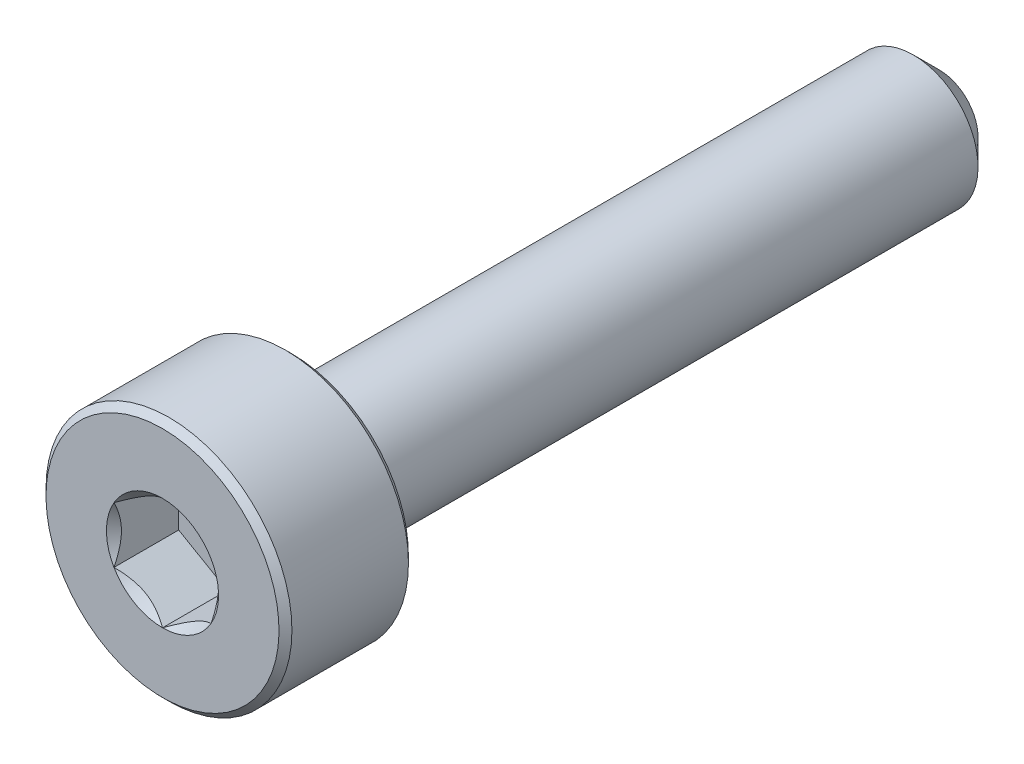
ISO-10303-21;
HEADER;
FILE_DESCRIPTION(('STEP AP214'),'2;1');
FILE_NAME('part.step','',(''),(''),'','','');
FILE_SCHEMA(('AUTOMOTIVE_DESIGN { 1 0 10303 214 1 1 1 1 }'));
ENDSEC;
DATA;
#1=APPLICATION_CONTEXT('core data for automotive mechanical design processes');
#2=APPLICATION_PROTOCOL_DEFINITION('international standard','automotive_design',2000,#1);
#3=PRODUCT_CONTEXT('',#1,'mechanical');
#4=PRODUCT('Part','Part','',(#3));
#5=PRODUCT_RELATED_PRODUCT_CATEGORY('part','',(#4));
#6=PRODUCT_DEFINITION_FORMATION('','',#4);
#7=PRODUCT_DEFINITION_CONTEXT('part definition',#1,'design');
#8=PRODUCT_DEFINITION('design','',#6,#7);
#9=PRODUCT_DEFINITION_SHAPE('','',#8);
#10=(LENGTH_UNIT() NAMED_UNIT(*) SI_UNIT(.MILLI.,.METRE.));
#11=(NAMED_UNIT(*) PLANE_ANGLE_UNIT() SI_UNIT($,.RADIAN.));
#12=(NAMED_UNIT(*) SI_UNIT($,.STERADIAN.) SOLID_ANGLE_UNIT());
#13=UNCERTAINTY_MEASURE_WITH_UNIT(LENGTH_MEASURE(1.E-05),#10,'distance_accuracy_value','');
#14=(GEOMETRIC_REPRESENTATION_CONTEXT(3) GLOBAL_UNCERTAINTY_ASSIGNED_CONTEXT((#13)) GLOBAL_UNIT_ASSIGNED_CONTEXT((#10,
#11,#12)) REPRESENTATION_CONTEXT('',''));
#15=CARTESIAN_POINT('',(0.,0.,0.));
#16=DIRECTION('',(0.,0.,1.));
#17=DIRECTION('',(1.,0.,0.));
#18=AXIS2_PLACEMENT_3D('',#15,#16,#17);
#19=CARTESIAN_POINT('',(0.,0.,6.));
#20=DIRECTION('',(0.,0.,1.));
#21=DIRECTION('',(0.,-1.,0.));
#22=AXIS2_PLACEMENT_3D('',#19,#20,#21);
#23=PLANE('',#22);
#24=CARTESIAN_POINT('',(0.,0.,6.));
#25=DIRECTION('',(0.,0.,1.));
#26=DIRECTION('',(1.,0.,0.));
#27=AXIS2_PLACEMENT_3D('',#24,#25,#26);
#28=CIRCLE('',#27,0.866025403784438);
#29=CARTESIAN_POINT('',(0.,-0.866025403784438,6.));
#30=VERTEX_POINT('',#29);
#31=CARTESIAN_POINT('',(0.75,-0.433012701892219,6.));
#32=VERTEX_POINT('',#31);
#33=EDGE_CURVE('E98',#30,#32,#28,.T.);
#34=ORIENTED_EDGE('',*,*,#33,.F.);
#35=CARTESIAN_POINT('',(-0.75,-0.433012701892219,6.));
#36=VERTEX_POINT('',#35);
#37=EDGE_CURVE('E268',#36,#30,#28,.T.);
#38=ORIENTED_EDGE('',*,*,#37,.F.);
#39=CARTESIAN_POINT('',(-0.75,0.433012701892219,6.));
#40=VERTEX_POINT('',#39);
#41=EDGE_CURVE('E133',#40,#36,#28,.T.);
#42=ORIENTED_EDGE('',*,*,#41,.F.);
#43=CARTESIAN_POINT('',(0.,0.866025403784438,6.));
#44=VERTEX_POINT('',#43);
#45=EDGE_CURVE('E129',#44,#40,#28,.T.);
#46=ORIENTED_EDGE('',*,*,#45,.F.);
#47=CARTESIAN_POINT('',(0.749999999999999,0.43301270189222,6.));
#48=VERTEX_POINT('',#47);
#49=EDGE_CURVE('E100',#48,#44,#28,.T.);
#50=ORIENTED_EDGE('',*,*,#49,.F.);
#51=EDGE_CURVE('E92',#32,#48,#28,.T.);
#52=ORIENTED_EDGE('',*,*,#51,.F.);
#53=EDGE_LOOP('',(#34,#38,#42,#46,#50,#52));
#54=FACE_BOUND('',#53,.T.);
#55=CARTESIAN_POINT('',(0.,0.,6.));
#56=DIRECTION('',(0.,0.,-1.));
#57=DIRECTION('',(0.,1.,0.));
#58=AXIS2_PLACEMENT_3D('',#55,#56,#57);
#59=CIRCLE('',#58,1.8);
#60=CARTESIAN_POINT('',(0.,1.8,6.));
#61=VERTEX_POINT('',#60);
#62=EDGE_CURVE('E48',#61,#61,#59,.T.);
#63=ORIENTED_EDGE('',*,*,#62,.F.);
#64=EDGE_LOOP('',(#63));
#65=FACE_BOUND('',#64,.T.);
#66=ADVANCED_FACE('F35',(#54,#65),#23,.T.);
#67=CARTESIAN_POINT('',(0.,0.,5.9));
#68=DIRECTION('',(0.,0.,-1.));
#69=DIRECTION('',(0.,1.,0.));
#70=AXIS2_PLACEMENT_3D('',#67,#68,#69);
#71=CONICAL_SURFACE('',#70,1.9,0.785398163397452);
#72=ORIENTED_EDGE('',*,*,#62,.T.);
#73=EDGE_LOOP('',(#72));
#74=FACE_BOUND('',#73,.T.);
#75=CARTESIAN_POINT('',(0.,0.,5.9));
#76=DIRECTION('',(0.,0.,-1.));
#77=DIRECTION('',(0.,1.,0.));
#78=AXIS2_PLACEMENT_3D('',#75,#76,#77);
#79=CIRCLE('',#78,1.9);
#80=CARTESIAN_POINT('',(0.,1.9,5.9));
#81=VERTEX_POINT('',#80);
#82=EDGE_CURVE('E219',#81,#81,#79,.T.);
#83=ORIENTED_EDGE('',*,*,#82,.F.);
#84=EDGE_LOOP('',(#83));
#85=FACE_BOUND('',#84,.T.);
#86=ADVANCED_FACE('F207',(#74,#85),#71,.T.);
#87=CARTESIAN_POINT('',(0.,0.,-6.));
#88=DIRECTION('',(0.,0.,-1.));
#89=DIRECTION('',(0.,1.,0.));
#90=AXIS2_PLACEMENT_3D('',#87,#88,#89);
#91=CYLINDRICAL_SURFACE('',#90,1.9);
#92=ORIENTED_EDGE('',*,*,#82,.T.);
#93=EDGE_LOOP('',(#92));
#94=FACE_BOUND('',#93,.T.);
#95=CARTESIAN_POINT('',(0.,0.,4.1));
#96=DIRECTION('',(0.,0.,-1.));
#97=DIRECTION('',(0.,1.,0.));
#98=AXIS2_PLACEMENT_3D('',#95,#96,#97);
#99=CIRCLE('',#98,1.9);
#100=CARTESIAN_POINT('',(0.,1.9,4.1));
#101=VERTEX_POINT('',#100);
#102=EDGE_CURVE('E220',#101,#101,#99,.T.);
#103=ORIENTED_EDGE('',*,*,#102,.F.);
#104=EDGE_LOOP('',(#103));
#105=FACE_BOUND('',#104,.T.);
#106=ADVANCED_FACE('F204',(#94,#105),#91,.T.);
#107=CARTESIAN_POINT('',(0.,0.,4.));
#108=DIRECTION('',(0.,0.,1.));
#109=DIRECTION('',(0.,-1.,0.));
#110=AXIS2_PLACEMENT_3D('',#107,#108,#109);
#111=CONICAL_SURFACE('',#110,1.8,0.785398163397443);
#112=ORIENTED_EDGE('',*,*,#102,.T.);
#113=EDGE_LOOP('',(#112));
#114=FACE_BOUND('',#113,.T.);
#115=CARTESIAN_POINT('',(0.,0.,4.));
#116=DIRECTION('',(0.,0.,-1.));
#117=DIRECTION('',(0.,1.,0.));
#118=AXIS2_PLACEMENT_3D('',#115,#116,#117);
#119=CIRCLE('',#118,1.8);
#120=CARTESIAN_POINT('',(0.,1.8,4.));
#121=VERTEX_POINT('',#120);
#122=EDGE_CURVE('E223',#121,#121,#119,.T.);
#123=ORIENTED_EDGE('',*,*,#122,.F.);
#124=EDGE_LOOP('',(#123));
#125=FACE_BOUND('',#124,.T.);
#126=ADVANCED_FACE('F200',(#114,#125),#111,.T.);
#127=CARTESIAN_POINT('',(0.,1.8,4.));
#128=DIRECTION('',(0.,0.,-1.));
#129=DIRECTION('',(0.,1.,0.));
#130=AXIS2_PLACEMENT_3D('',#127,#128,#129);
#131=PLANE('',#130);
#132=ORIENTED_EDGE('',*,*,#122,.T.);
#133=EDGE_LOOP('',(#132));
#134=FACE_BOUND('',#133,.T.);
#135=CARTESIAN_POINT('',(0.,0.,4.));
#136=DIRECTION('',(0.,0.,-1.));
#137=DIRECTION('',(0.,1.,0.));
#138=AXIS2_PLACEMENT_3D('',#135,#136,#137);
#139=CIRCLE('',#138,1.);
#140=CARTESIAN_POINT('',(0.,1.,4.));
#141=VERTEX_POINT('',#140);
#142=EDGE_CURVE('E228',#141,#141,#139,.T.);
#143=ORIENTED_EDGE('',*,*,#142,.F.);
#144=EDGE_LOOP('',(#143));
#145=FACE_BOUND('',#144,.T.);
#146=ADVANCED_FACE('F196',(#134,#145),#131,.T.);
#147=CARTESIAN_POINT('',(0.,0.,-6.));
#148=DIRECTION('',(0.,0.,-1.));
#149=DIRECTION('',(0.,1.,0.));
#150=AXIS2_PLACEMENT_3D('',#147,#148,#149);
#151=CYLINDRICAL_SURFACE('',#150,1.);
#152=ORIENTED_EDGE('',*,*,#142,.T.);
#153=EDGE_LOOP('',(#152));
#154=FACE_BOUND('',#153,.T.);
#155=CARTESIAN_POINT('',(0.,0.,-5.59999999999999));
#156=DIRECTION('',(0.,0.,-1.));
#157=DIRECTION('',(0.,1.,0.));
#158=AXIS2_PLACEMENT_3D('',#155,#156,#157);
#159=CIRCLE('',#158,1.);
#160=CARTESIAN_POINT('',(0.,1.,-5.59999999999999));
#161=VERTEX_POINT('',#160);
#162=EDGE_CURVE('E231',#161,#161,#159,.T.);
#163=ORIENTED_EDGE('',*,*,#162,.F.);
#164=EDGE_LOOP('',(#163));
#165=FACE_BOUND('',#164,.T.);
#166=ADVANCED_FACE('F192',(#154,#165),#151,.T.);
#167=CARTESIAN_POINT('',(0.,0.,-6.));
#168=DIRECTION('',(0.,0.,1.));
#169=DIRECTION('',(0.,-1.,0.));
#170=AXIS2_PLACEMENT_3D('',#167,#168,#169);
#171=CONICAL_SURFACE('',#170,0.6,0.78539816339744);
#172=ORIENTED_EDGE('',*,*,#162,.T.);
#173=EDGE_LOOP('',(#172));
#174=FACE_BOUND('',#173,.T.);
#175=CARTESIAN_POINT('',(0.,0.,-6.));
#176=DIRECTION('',(0.,0.,-1.));
#177=DIRECTION('',(0.,1.,0.));
#178=AXIS2_PLACEMENT_3D('',#175,#176,#177);
#179=CIRCLE('',#178,0.6);
#180=CARTESIAN_POINT('',(0.,0.6,-6.));
#181=VERTEX_POINT('',#180);
#182=EDGE_CURVE('E234',#181,#181,#179,.T.);
#183=ORIENTED_EDGE('',*,*,#182,.F.);
#184=EDGE_LOOP('',(#183));
#185=FACE_BOUND('',#184,.T.);
#186=ADVANCED_FACE('F188',(#174,#185),#171,.T.);
#187=CARTESIAN_POINT('',(0.,0.6,-6.));
#188=DIRECTION('',(0.,0.,-1.));
#189=DIRECTION('',(0.,1.,0.));
#190=AXIS2_PLACEMENT_3D('',#187,#188,#189);
#191=PLANE('',#190);
#192=ORIENTED_EDGE('',*,*,#182,.T.);
#193=EDGE_LOOP('',(#192));
#194=FACE_BOUND('',#193,.T.);
#195=ADVANCED_FACE('F185',(#194),#191,.T.);
#196=CARTESIAN_POINT('',(0.,0.,6.));
#197=DIRECTION('',(0.,0.,1.));
#198=DIRECTION('',(1.,0.,0.));
#199=AXIS2_PLACEMENT_3D('',#196,#197,#198);
#200=CONICAL_SURFACE('',#199,0.866025403784438,0.78539816339745);
#201=ORIENTED_EDGE('',*,*,#33,.T.);
#202=CARTESIAN_POINT('',(-0.000200000000000018,-0.866140873838276,6.00011549314477));
#203=CARTESIAN_POINT('',(0.0255899625576815,-0.851251032013208,5.98523411046392));
#204=CARTESIAN_POINT('',(0.0518112021286593,-0.836112192288419,5.97122626560696));
#205=CARTESIAN_POINT('',(0.105279708235707,-0.805242135894348,5.94557752468226));
#206=CARTESIAN_POINT('',(0.132532067460573,-0.789507978959819,5.93395091170567));
#207=CARTESIAN_POINT('',(0.187485350381354,-0.757780686272652,5.91403404577224));
#208=CARTESIAN_POINT('',(0.21517225669551,-0.741795643459146,5.90569369408137));
#209=CARTESIAN_POINT('',(0.271155595130854,-0.709473647943366,5.89284274196143));
#210=CARTESIAN_POINT('',(0.299450314843646,-0.693137683900541,5.88832254058884));
#211=CARTESIAN_POINT('',(0.348210289268844,-0.664986099540473,5.88424583309744));
#212=CARTESIAN_POINT('',(0.368612065655574,-0.653207128451649,5.88364279661408));
#213=CARTESIAN_POINT('',(0.409376134696361,-0.629671982217685,5.88465450601553));
#214=CARTESIAN_POINT('',(0.429738417651456,-0.617915812672246,5.88626974099003));
#215=CARTESIAN_POINT('',(0.490534543086825,-0.58281515328645,5.89433614697304));
#216=CARTESIAN_POINT('',(0.5306658549961,-0.559645329552697,5.90400893582772));
#217=CARTESIAN_POINT('',(0.601110400354027,-0.518974152327357,5.92735631797231));
#218=CARTESIAN_POINT('',(0.631753572009087,-0.501282308923484,5.93980855807225));
#219=CARTESIAN_POINT('',(0.69183934580479,-0.466591771248068,5.96785961023086));
#220=CARTESIAN_POINT('',(0.721285488381591,-0.449591032904756,5.98344818590375));
#221=CARTESIAN_POINT('',(0.7502,-0.432897231838381,6.00011549314477));
#222=B_SPLINE_CURVE_WITH_KNOTS('',3,(#202,#203,#204,#205,#206,#207,#208,#209,#210,#211,#212,
#213,#214,#215,#216,#217,#218,#219,#220,#221),.UNSPECIFIED.,.F.,.F.,(4,2,2,2,2,2,2,2,2,4),(0.,
0.0999419466095601,0.200466857654447,0.299393763705719,0.398071297300232,0.468665775681749,
0.539275821398841,0.680536257244568,0.792918418368075,0.904939568716032),.UNSPECIFIED.);
#223=EDGE_CURVE('E12',#30,#32,#222,.T.);
#224=ORIENTED_EDGE('',*,*,#223,.F.);
#225=EDGE_LOOP('',(#201,#224));
#226=FACE_BOUND('',#225,.T.);
#227=ADVANCED_FACE('F151',(#226),#200,.F.);
#228=ORIENTED_EDGE('',*,*,#37,.T.);
#229=CARTESIAN_POINT('',(-0.7502,-0.432897231838381,6.00011549314477));
#230=CARTESIAN_POINT('',(-0.724410037442318,-0.447787073663449,5.98523411046392));
#231=CARTESIAN_POINT('',(-0.698188797871341,-0.462925913388239,5.97122626560696));
#232=CARTESIAN_POINT('',(-0.644720291764293,-0.493795969782309,5.94557752468226));
#233=CARTESIAN_POINT('',(-0.617467932539427,-0.509530126716838,5.93395091170567));
#234=CARTESIAN_POINT('',(-0.562514649618647,-0.541257419404005,5.91403404577224));
#235=CARTESIAN_POINT('',(-0.53482774330449,-0.557242462217511,5.90569369408137));
#236=CARTESIAN_POINT('',(-0.478844404869146,-0.589564457733291,5.89284274196143));
#237=CARTESIAN_POINT('',(-0.450549685156354,-0.605900421776116,5.88832254058884));
#238=CARTESIAN_POINT('',(-0.401789710731156,-0.634052006136184,5.88424583309744));
#239=CARTESIAN_POINT('',(-0.381387934344426,-0.645830977225008,5.88364279661408));
#240=CARTESIAN_POINT('',(-0.340623865303639,-0.669366123458972,5.88465450601553));
#241=CARTESIAN_POINT('',(-0.320261582348544,-0.681122293004411,5.88626974099003));
#242=CARTESIAN_POINT('',(-0.259465456913175,-0.716222952390207,5.89433614697304));
#243=CARTESIAN_POINT('',(-0.2193341450039,-0.73939277612396,5.90400893582772));
#244=CARTESIAN_POINT('',(-0.148889599645973,-0.7800639533493,5.92735631797231));
#245=CARTESIAN_POINT('',(-0.118246427990913,-0.797755796753173,5.93980855807225));
#246=CARTESIAN_POINT('',(-0.0581606541952095,-0.832446334428589,5.96785961023086));
#247=CARTESIAN_POINT('',(-0.0287145116184087,-0.849447072771901,5.98344818590375));
#248=CARTESIAN_POINT('',(0.000200000000000237,-0.866140873838276,6.00011549314477));
#249=B_SPLINE_CURVE_WITH_KNOTS('',3,(#229,#230,#231,#232,#233,#234,#235,#236,#237,#238,#239,
#240,#241,#242,#243,#244,#245,#246,#247,#248),.UNSPECIFIED.,.F.,.F.,(4,2,2,2,2,2,2,2,2,4),(0.,
0.0999419466095595,0.200466857654446,0.299393763705718,0.398071297300231,0.468665775681749,
0.53927582139884,0.680536257244567,0.792918418368074,0.904939568716032),.UNSPECIFIED.);
#250=EDGE_CURVE('E130',#36,#30,#249,.T.);
#251=ORIENTED_EDGE('',*,*,#250,.F.);
#252=EDGE_LOOP('',(#228,#251));
#253=FACE_BOUND('',#252,.T.);
#254=ADVANCED_FACE('F266',(#253),#200,.F.);
#255=ORIENTED_EDGE('',*,*,#41,.T.);
#256=CARTESIAN_POINT('',(-0.75,-0.863604064848462,6.2777892581354));
#257=CARTESIAN_POINT('',(-0.75,-0.842575879734332,6.26191493200841));
#258=CARTESIAN_POINT('',(-0.75,-0.82143049629156,6.246196265183));
#259=CARTESIAN_POINT('',(-0.75,-0.778857857419019,6.21513452062663));
#260=CARTESIAN_POINT('',(-0.75,-0.757430533042236,6.19979153749355));
#261=CARTESIAN_POINT('',(-0.75,-0.692340710712935,6.15420358029367));
#262=CARTESIAN_POINT('',(-0.75,-0.648190081053413,6.12464409174343));
#263=CARTESIAN_POINT('',(-0.75,-0.55560718150175,6.0666155826928));
#264=CARTESIAN_POINT('',(-0.75,-0.507074363017996,6.03830510936579));
#265=CARTESIAN_POINT('',(-0.75,-0.407587529772337,5.98651811176889));
#266=CARTESIAN_POINT('',(-0.75,-0.35664241954847,5.96302529153185));
#267=CARTESIAN_POINT('',(-0.75,-0.28016546882077,5.93428689950068));
#268=CARTESIAN_POINT('',(-0.75,-0.255770023930571,5.92603927481306));
#269=CARTESIAN_POINT('',(-0.75,-0.206403277885131,5.91149717542019));
#270=CARTESIAN_POINT('',(-0.75,-0.181431937185907,5.90520283526912));
#271=CARTESIAN_POINT('',(-0.75,-0.106699879404924,5.8899931738806));
#272=CARTESIAN_POINT('',(-0.75,-0.0561907171762171,5.88437718471289));
#273=CARTESIAN_POINT('',(-0.75,0.0430767231749066,5.88362825645435));
#274=CARTESIAN_POINT('',(-0.75,0.0918322434166288,5.88812345140561));
#275=CARTESIAN_POINT('',(-0.75,0.164112195698295,5.90133730744598));
#276=CARTESIAN_POINT('',(-0.75,0.188278676879437,5.90690144638208));
#277=CARTESIAN_POINT('',(-0.75,0.236094480120331,5.91992316614873));
#278=CARTESIAN_POINT('',(-0.75,0.259743845273041,5.92738058854766));
#279=CARTESIAN_POINT('',(-0.75,0.33419827846382,5.95366646946609));
#280=CARTESIAN_POINT('',(-0.75,0.383940060445496,5.97549033804844));
#281=CARTESIAN_POINT('',(-0.75,0.481089225076667,6.02401180410059));
#282=CARTESIAN_POINT('',(-0.75,0.528487417973018,6.05072691131035));
#283=CARTESIAN_POINT('',(-0.75,0.619071540465252,6.10584285115078));
#284=CARTESIAN_POINT('',(-0.75,0.66234974530024,6.13409394545219));
#285=CARTESIAN_POINT('',(-0.75,0.726111623216225,6.17776714709751));
#286=CARTESIAN_POINT('',(-0.75,0.747090419255281,6.1924788605167));
#287=CARTESIAN_POINT('',(-0.75,0.788761341501861,6.2222913841024));
#288=CARTESIAN_POINT('',(-0.75,0.80945354453562,6.23739208676303));
#289=CARTESIAN_POINT('',(-0.75,0.830026390097469,6.25265408930473));
#290=B_SPLINE_CURVE_WITH_KNOTS('',3,(#256,#257,#258,#259,#260,#261,#262,#263,#264,#265,#266,
#267,#268,#269,#270,#271,#272,#273,#274,#275,#276,#277,#278,#279,#280,#281,#282,#283,#284,#285,
#286,#287,#288,#289),.UNSPECIFIED.,.F.,.F.,(4,2,2,2,2,2,2,2,2,2,2,2,2,2,2,2,4),(0.,
0.0790398443124681,0.158099390497593,0.317425208674102,0.485845155681377,0.653685658303956,
0.730869805636065,0.808059268704008,0.959469653380779,1.10540290447489,1.17973203111653,
1.25405493988072,1.41653726506054,1.57961304287543,1.73458511695816,1.81145152932467,
1.8882969211581),.UNSPECIFIED.);
#291=EDGE_CURVE('E131',#40,#36,#290,.F.);
#292=ORIENTED_EDGE('',*,*,#291,.F.);
#293=EDGE_LOOP('',(#255,#292));
#294=FACE_BOUND('',#293,.T.);
#295=ADVANCED_FACE('F271',(#294),#200,.F.);
#296=ORIENTED_EDGE('',*,*,#45,.T.);
#297=CARTESIAN_POINT('',(0.000200000000000151,0.866140873838276,6.00011549314477));
#298=CARTESIAN_POINT('',(-0.0255899625576814,0.851251032013209,5.98523411046392));
#299=CARTESIAN_POINT('',(-0.0518112021286591,0.836112192288419,5.97122626560696));
#300=CARTESIAN_POINT('',(-0.105279708235706,0.805242135894348,5.94557752468226));
#301=CARTESIAN_POINT('',(-0.132532067460573,0.789507978959819,5.93395091170567));
#302=CARTESIAN_POINT('',(-0.187485350381353,0.757780686272653,5.91403404577224));
#303=CARTESIAN_POINT('',(-0.21517225669551,0.741795643459147,5.90569369408137));
#304=CARTESIAN_POINT('',(-0.271155595130853,0.709473647943367,5.89284274196143));
#305=CARTESIAN_POINT('',(-0.299450314843645,0.693137683900541,5.88832254058884));
#306=CARTESIAN_POINT('',(-0.348210289268844,0.664986099540474,5.88424583309744));
#307=CARTESIAN_POINT('',(-0.368612065655573,0.653207128451649,5.88364279661408));
#308=CARTESIAN_POINT('',(-0.409376134696361,0.629671982217686,5.88465450601553));
#309=CARTESIAN_POINT('',(-0.429738417651456,0.617915812672247,5.88626974099003));
#310=CARTESIAN_POINT('',(-0.490534543086824,0.58281515328645,5.89433614697304));
#311=CARTESIAN_POINT('',(-0.5306658549961,0.559645329552697,5.90400893582772));
#312=CARTESIAN_POINT('',(-0.601110400354026,0.518974152327358,5.92735631797231));
#313=CARTESIAN_POINT('',(-0.631753572009087,0.501282308923484,5.93980855807225));
#314=CARTESIAN_POINT('',(-0.69183934580479,0.466591771248068,5.96785961023086));
#315=CARTESIAN_POINT('',(-0.721285488381591,0.449591032904756,5.98344818590375));
#316=CARTESIAN_POINT('',(-0.7502,0.432897231838381,6.00011549314477));
#317=B_SPLINE_CURVE_WITH_KNOTS('',3,(#297,#298,#299,#300,#301,#302,#303,#304,#305,#306,#307,
#308,#309,#310,#311,#312,#313,#314,#315,#316),.UNSPECIFIED.,.F.,.F.,(4,2,2,2,2,2,2,2,2,4),(0.,
0.0999419466095596,0.200466857654446,0.299393763705718,0.398071297300231,0.468665775681749,
0.53927582139884,0.680536257244567,0.792918418368074,0.904939568716032),.UNSPECIFIED.);
#318=EDGE_CURVE('E110',#44,#40,#317,.T.);
#319=ORIENTED_EDGE('',*,*,#318,.F.);
#320=EDGE_LOOP('',(#296,#319));
#321=FACE_BOUND('',#320,.T.);
#322=ADVANCED_FACE('F305',(#321),#200,.F.);
#323=ORIENTED_EDGE('',*,*,#49,.T.);
#324=CARTESIAN_POINT('',(0.7502,0.432897231838381,6.00011549314477));
#325=CARTESIAN_POINT('',(0.724410037442319,0.447787073663449,5.98523411046392));
#326=CARTESIAN_POINT('',(0.698188797871341,0.462925913388239,5.97122626560696));
#327=CARTESIAN_POINT('',(0.644720291764294,0.49379596978231,5.94557752468226));
#328=CARTESIAN_POINT('',(0.617467932539427,0.509530126716839,5.93395091170567));
#329=CARTESIAN_POINT('',(0.562514649618647,0.541257419404005,5.91403404577224));
#330=CARTESIAN_POINT('',(0.534827743304491,0.557242462217511,5.90569369408137));
#331=CARTESIAN_POINT('',(0.478844404869147,0.58956445773329,5.89284274196143));
#332=CARTESIAN_POINT('',(0.450549685156355,0.605900421776116,5.88832254058884));
#333=CARTESIAN_POINT('',(0.401789710731157,0.634052006136183,5.88424583309744));
#334=CARTESIAN_POINT('',(0.381387934344428,0.645830977225008,5.88364279661408));
#335=CARTESIAN_POINT('',(0.34062386530364,0.669366123458971,5.88465450601553));
#336=CARTESIAN_POINT('',(0.320261582348545,0.681122293004411,5.88626974099003));
#337=CARTESIAN_POINT('',(0.259465456913177,0.716222952390207,5.89433614697304));
#338=CARTESIAN_POINT('',(0.219334145003901,0.73939277612396,5.90400893582772));
#339=CARTESIAN_POINT('',(0.148889599645975,0.780063953349299,5.92735631797231));
#340=CARTESIAN_POINT('',(0.118246427990914,0.797755796753173,5.93980855807225));
#341=CARTESIAN_POINT('',(0.0581606541952104,0.832446334428589,5.96785961023086));
#342=CARTESIAN_POINT('',(0.0287145116184094,0.849447072771901,5.98344818590375));
#343=CARTESIAN_POINT('',(-0.000200000000000016,0.866140873838276,6.00011549314477));
#344=B_SPLINE_CURVE_WITH_KNOTS('',3,(#324,#325,#326,#327,#328,#329,#330,#331,#332,#333,#334,
#335,#336,#337,#338,#339,#340,#341,#342,#343),.UNSPECIFIED.,.F.,.F.,(4,2,2,2,2,2,2,2,2,4),(0.,
0.0999419466095594,0.200466857654446,0.299393763705717,0.39807129730023,0.468665775681747,
0.539275821398839,0.680536257244566,0.792918418368073,0.904939568716032),.UNSPECIFIED.);
#345=EDGE_CURVE('E103',#48,#44,#344,.T.);
#346=ORIENTED_EDGE('',*,*,#345,.F.);
#347=EDGE_LOOP('',(#323,#346));
#348=FACE_BOUND('',#347,.T.);
#349=ADVANCED_FACE('F104',(#348),#200,.F.);
#350=ORIENTED_EDGE('',*,*,#51,.T.);
#351=CARTESIAN_POINT('',(0.75,-0.863604064848461,6.2777892581354));
#352=CARTESIAN_POINT('',(0.75,-0.842575879734331,6.26191493200841));
#353=CARTESIAN_POINT('',(0.75,-0.821430496291559,6.246196265183));
#354=CARTESIAN_POINT('',(0.75,-0.778857857419018,6.21513452062663));
#355=CARTESIAN_POINT('',(0.75,-0.757430533042235,6.19979153749355));
#356=CARTESIAN_POINT('',(0.75,-0.692340710712934,6.15420358029367));
#357=CARTESIAN_POINT('',(0.75,-0.648190081053412,6.12464409174343));
#358=CARTESIAN_POINT('',(0.75,-0.555607181501749,6.0666155826928));
#359=CARTESIAN_POINT('',(0.75,-0.507074363017995,6.03830510936579));
#360=CARTESIAN_POINT('',(0.75,-0.407587529772336,5.98651811176889));
#361=CARTESIAN_POINT('',(0.75,-0.356642419548469,5.96302529153185));
#362=CARTESIAN_POINT('',(0.75,-0.28016546882077,5.93428689950068));
#363=CARTESIAN_POINT('',(0.75,-0.255770023930571,5.92603927481306));
#364=CARTESIAN_POINT('',(0.75,-0.20640327788513,5.91149717542019));
#365=CARTESIAN_POINT('',(0.75,-0.181431937185906,5.90520283526912));
#366=CARTESIAN_POINT('',(0.75,-0.106699879404923,5.8899931738806));
#367=CARTESIAN_POINT('',(0.75,-0.0561907171762164,5.88437718471289));
#368=CARTESIAN_POINT('',(0.75,0.043076723174907,5.88362825645435));
#369=CARTESIAN_POINT('',(0.75,0.0918322434166292,5.88812345140561));
#370=CARTESIAN_POINT('',(0.75,0.164112195698295,5.90133730744598));
#371=CARTESIAN_POINT('',(0.75,0.188278676879437,5.90690144638208));
#372=CARTESIAN_POINT('',(0.75,0.236094480120331,5.91992316614873));
#373=CARTESIAN_POINT('',(0.75,0.259743845273042,5.92738058854766));
#374=CARTESIAN_POINT('',(0.75,0.33419827846382,5.95366646946609));
#375=CARTESIAN_POINT('',(0.75,0.383940060445496,5.97549033804844));
#376=CARTESIAN_POINT('',(0.75,0.481089225076667,6.02401180410059));
#377=CARTESIAN_POINT('',(0.75,0.528487417973018,6.05072691131035));
#378=CARTESIAN_POINT('',(0.75,0.619071540465253,6.10584285115078));
#379=CARTESIAN_POINT('',(0.75,0.662349745300241,6.13409394545219));
#380=CARTESIAN_POINT('',(0.75,0.726111623216226,6.17776714709751));
#381=CARTESIAN_POINT('',(0.75,0.747090419255282,6.1924788605167));
#382=CARTESIAN_POINT('',(0.75,0.788761341501862,6.2222913841024));
#383=CARTESIAN_POINT('',(0.75,0.809453544535621,6.23739208676303));
#384=CARTESIAN_POINT('',(0.75,0.83002639009747,6.25265408930473));
#385=B_SPLINE_CURVE_WITH_KNOTS('',3,(#351,#352,#353,#354,#355,#356,#357,#358,#359,#360,#361,
#362,#363,#364,#365,#366,#367,#368,#369,#370,#371,#372,#373,#374,#375,#376,#377,#378,#379,#380,
#381,#382,#383,#384),.UNSPECIFIED.,.F.,.F.,(4,2,2,2,2,2,2,2,2,2,2,2,2,2,2,2,4),(0.,
0.0790398443124674,0.158099390497593,0.317425208674101,0.485845155681376,0.653685658303956,
0.730869805636064,0.808059268704007,0.959469653380778,1.10540290447489,1.17973203111653,
1.25405493988072,1.41653726506053,1.57961304287543,1.73458511695816,1.81145152932466,
1.8882969211581),.UNSPECIFIED.);
#386=EDGE_CURVE('E54',#32,#48,#385,.T.);
#387=ORIENTED_EDGE('',*,*,#386,.F.);
#388=EDGE_LOOP('',(#350,#387));
#389=FACE_BOUND('',#388,.T.);
#390=ADVANCED_FACE('F94',(#389),#200,.F.);
#391=CARTESIAN_POINT('',(0.,1.8,5.));
#392=DIRECTION('',(0.,0.,-1.));
#393=DIRECTION('',(0.,1.,0.));
#394=AXIS2_PLACEMENT_3D('',#391,#392,#393);
#395=PLANE('',#394);
#396=DIRECTION('',(0.866025403784439,0.5,0.));
#397=VECTOR('',#396,1.);
#398=CARTESIAN_POINT('',(0.,-0.866025403784438,5.));
#399=LINE('',#398,#397);
#400=CARTESIAN_POINT('',(0.,-0.866025403784438,5.));
#401=VERTEX_POINT('',#400);
#402=CARTESIAN_POINT('',(0.75,-0.433012701892219,5.));
#403=VERTEX_POINT('',#402);
#404=EDGE_CURVE('E237',#401,#403,#399,.T.);
#405=ORIENTED_EDGE('',*,*,#404,.T.);
#406=DIRECTION('',(0.,1.,0.));
#407=VECTOR('',#406,1.);
#408=CARTESIAN_POINT('',(0.75,-0.433012701892219,5.));
#409=LINE('',#408,#407);
#410=CARTESIAN_POINT('',(0.75,0.433012701892219,5.));
#411=VERTEX_POINT('',#410);
#412=EDGE_CURVE('E120',#403,#411,#409,.T.);
#413=ORIENTED_EDGE('',*,*,#412,.T.);
#414=DIRECTION('',(-0.866025403784439,0.5,0.));
#415=VECTOR('',#414,1.);
#416=CARTESIAN_POINT('',(0.75,0.433012701892219,5.));
#417=LINE('',#416,#415);
#418=CARTESIAN_POINT('',(0.,0.866025403784438,5.));
#419=VERTEX_POINT('',#418);
#420=EDGE_CURVE('E124',#411,#419,#417,.T.);
#421=ORIENTED_EDGE('',*,*,#420,.T.);
#422=DIRECTION('',(-0.866025403784439,-0.5,0.));
#423=VECTOR('',#422,1.);
#424=CARTESIAN_POINT('',(0.,0.866025403784438,5.));
#425=LINE('',#424,#423);
#426=CARTESIAN_POINT('',(-0.75,0.433012701892219,5.));
#427=VERTEX_POINT('',#426);
#428=EDGE_CURVE('E241',#419,#427,#425,.T.);
#429=ORIENTED_EDGE('',*,*,#428,.T.);
#430=DIRECTION('',(0.,-1.,0.));
#431=VECTOR('',#430,1.);
#432=CARTESIAN_POINT('',(-0.75,0.433012701892219,5.));
#433=LINE('',#432,#431);
#434=CARTESIAN_POINT('',(-0.75,-0.433012701892219,5.));
#435=VERTEX_POINT('',#434);
#436=EDGE_CURVE('E245',#427,#435,#433,.T.);
#437=ORIENTED_EDGE('',*,*,#436,.T.);
#438=DIRECTION('',(0.866025403784439,-0.5,0.));
#439=VECTOR('',#438,1.);
#440=CARTESIAN_POINT('',(-0.75,-0.433012701892219,5.));
#441=LINE('',#440,#439);
#442=EDGE_CURVE('E247',#435,#401,#441,.T.);
#443=ORIENTED_EDGE('',*,*,#442,.T.);
#444=EDGE_LOOP('',(#405,#413,#421,#429,#437,#443));
#445=FACE_BOUND('',#444,.T.);
#446=ADVANCED_FACE('F150',(#445),#395,.F.);
#447=CARTESIAN_POINT('',(0.,-0.866025403784438,1.70871215252208));
#448=DIRECTION('',(0.5,-0.866025403784439,0.));
#449=DIRECTION('',(0.866025403784439,0.5,0.));
#450=AXIS2_PLACEMENT_3D('',#447,#448,#449);
#451=PLANE('',#450);
#452=DIRECTION('',(0.,0.,1.));
#453=VECTOR('',#452,1.);
#454=CARTESIAN_POINT('',(0.,-0.866025403784438,1.70871215252208));
#455=LINE('',#454,#453);
#456=EDGE_CURVE('E248',#401,#30,#455,.T.);
#457=ORIENTED_EDGE('',*,*,#456,.T.);
#458=ORIENTED_EDGE('',*,*,#223,.T.);
#459=DIRECTION('',(0.,0.,1.));
#460=VECTOR('',#459,1.);
#461=CARTESIAN_POINT('',(0.75,-0.433012701892219,1.70871215252208));
#462=LINE('',#461,#460);
#463=EDGE_CURVE('E119',#403,#32,#462,.T.);
#464=ORIENTED_EDGE('',*,*,#463,.F.);
#465=ORIENTED_EDGE('',*,*,#404,.F.);
#466=EDGE_LOOP('',(#457,#458,#464,#465));
#467=FACE_BOUND('',#466,.T.);
#468=ADVANCED_FACE('F152',(#467),#451,.F.);
#469=CARTESIAN_POINT('',(-0.75,-0.433012701892219,1.70871215252208));
#470=DIRECTION('',(-0.5,-0.866025403784439,0.));
#471=DIRECTION('',(0.866025403784439,-0.5,0.));
#472=AXIS2_PLACEMENT_3D('',#469,#470,#471);
#473=PLANE('',#472);
#474=DIRECTION('',(0.,0.,1.));
#475=VECTOR('',#474,1.);
#476=CARTESIAN_POINT('',(-0.75,-0.433012701892219,1.70871215252208));
#477=LINE('',#476,#475);
#478=EDGE_CURVE('E62',#435,#36,#477,.T.);
#479=ORIENTED_EDGE('',*,*,#478,.T.);
#480=ORIENTED_EDGE('',*,*,#250,.T.);
#481=ORIENTED_EDGE('',*,*,#456,.F.);
#482=ORIENTED_EDGE('',*,*,#442,.F.);
#483=EDGE_LOOP('',(#479,#480,#481,#482));
#484=FACE_BOUND('',#483,.T.);
#485=ADVANCED_FACE('F146',(#484),#473,.F.);
#486=CARTESIAN_POINT('',(-0.75,0.433012701892219,1.70871215252208));
#487=DIRECTION('',(-1.,0.,0.));
#488=DIRECTION('',(0.,-1.,0.));
#489=AXIS2_PLACEMENT_3D('',#486,#487,#488);
#490=PLANE('',#489);
#491=DIRECTION('',(0.,0.,1.));
#492=VECTOR('',#491,1.);
#493=CARTESIAN_POINT('',(-0.75,0.433012701892219,1.70871215252208));
#494=LINE('',#493,#492);
#495=EDGE_CURVE('E242',#427,#40,#494,.T.);
#496=ORIENTED_EDGE('',*,*,#495,.T.);
#497=ORIENTED_EDGE('',*,*,#291,.T.);
#498=ORIENTED_EDGE('',*,*,#478,.F.);
#499=ORIENTED_EDGE('',*,*,#436,.F.);
#500=EDGE_LOOP('',(#496,#497,#498,#499));
#501=FACE_BOUND('',#500,.T.);
#502=ADVANCED_FACE('F277',(#501),#490,.F.);
#503=CARTESIAN_POINT('',(0.,0.866025403784438,1.70871215252208));
#504=DIRECTION('',(-0.5,0.866025403784439,0.));
#505=DIRECTION('',(-0.866025403784439,-0.5,0.));
#506=AXIS2_PLACEMENT_3D('',#503,#504,#505);
#507=PLANE('',#506);
#508=DIRECTION('',(0.,0.,1.));
#509=VECTOR('',#508,1.);
#510=CARTESIAN_POINT('',(0.,0.866025403784438,1.70871215252208));
#511=LINE('',#510,#509);
#512=EDGE_CURVE('E239',#419,#44,#511,.T.);
#513=ORIENTED_EDGE('',*,*,#512,.T.);
#514=ORIENTED_EDGE('',*,*,#318,.T.);
#515=ORIENTED_EDGE('',*,*,#495,.F.);
#516=ORIENTED_EDGE('',*,*,#428,.F.);
#517=EDGE_LOOP('',(#513,#514,#515,#516));
#518=FACE_BOUND('',#517,.T.);
#519=ADVANCED_FACE('F177',(#518),#507,.F.);
#520=CARTESIAN_POINT('',(0.75,0.433012701892219,1.70871215252208));
#521=DIRECTION('',(0.5,0.866025403784439,0.));
#522=DIRECTION('',(-0.866025403784439,0.5,0.));
#523=AXIS2_PLACEMENT_3D('',#520,#521,#522);
#524=PLANE('',#523);
#525=DIRECTION('',(0.,0.,1.));
#526=VECTOR('',#525,1.);
#527=CARTESIAN_POINT('',(0.75,0.433012701892219,1.70871215252208));
#528=LINE('',#527,#526);
#529=EDGE_CURVE('E116',#411,#48,#528,.T.);
#530=ORIENTED_EDGE('',*,*,#529,.T.);
#531=ORIENTED_EDGE('',*,*,#345,.T.);
#532=ORIENTED_EDGE('',*,*,#512,.F.);
#533=ORIENTED_EDGE('',*,*,#420,.F.);
#534=EDGE_LOOP('',(#530,#531,#532,#533));
#535=FACE_BOUND('',#534,.T.);
#536=ADVANCED_FACE('F122',(#535),#524,.F.);
#537=CARTESIAN_POINT('',(0.75,-0.433012701892219,1.70871215252208));
#538=DIRECTION('',(1.,0.,0.));
#539=DIRECTION('',(0.,0.,-1.));
#540=AXIS2_PLACEMENT_3D('',#537,#538,#539);
#541=PLANE('',#540);
#542=ORIENTED_EDGE('',*,*,#463,.T.);
#543=ORIENTED_EDGE('',*,*,#386,.T.);
#544=ORIENTED_EDGE('',*,*,#529,.F.);
#545=ORIENTED_EDGE('',*,*,#412,.F.);
#546=EDGE_LOOP('',(#542,#543,#544,#545));
#547=FACE_BOUND('',#546,.T.);
#548=ADVANCED_FACE('F115',(#547),#541,.F.);
#549=CLOSED_SHELL('',(#66,#86,#106,#126,#146,#166,#186,#195,#227,#254,#295,#322,#349,#390,#446,
#468,#485,#502,#519,#536,#548));
#550=MANIFOLD_SOLID_BREP('B2',#549);
#551=ADVANCED_BREP_SHAPE_REPRESENTATION('',(#18,#550),#14);
#552=SHAPE_DEFINITION_REPRESENTATION(#9,#551);
ENDSEC;
END-ISO-10303-21;
